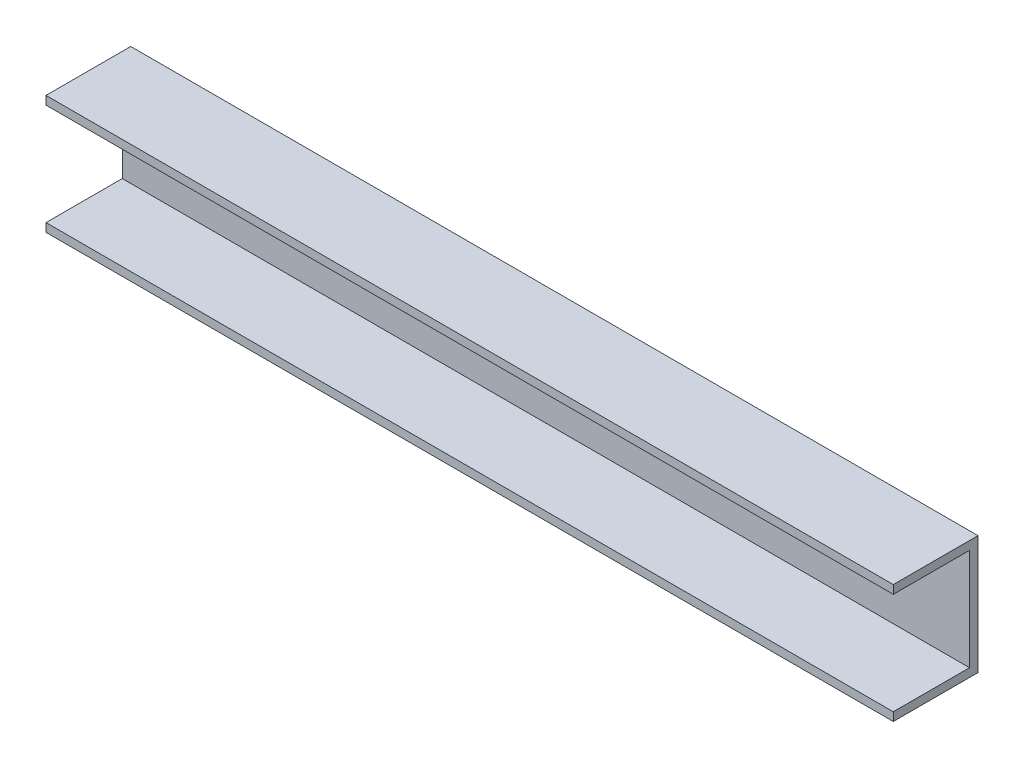
ISO-10303-21;
HEADER;
FILE_DESCRIPTION(('STEP AP214'),'2;1');
FILE_NAME('part.step','',(''),(''),'','','');
FILE_SCHEMA(('AUTOMOTIVE_DESIGN { 1 0 10303 214 1 1 1 1 }'));
ENDSEC;
DATA;
#1=APPLICATION_CONTEXT('core data for automotive mechanical design processes');
#2=APPLICATION_PROTOCOL_DEFINITION('international standard','automotive_design',2000,#1);
#3=PRODUCT_CONTEXT('',#1,'mechanical');
#4=PRODUCT('Part','Part','',(#3));
#5=PRODUCT_RELATED_PRODUCT_CATEGORY('part','',(#4));
#6=PRODUCT_DEFINITION_FORMATION('','',#4);
#7=PRODUCT_DEFINITION_CONTEXT('part definition',#1,'design');
#8=PRODUCT_DEFINITION('design','',#6,#7);
#9=PRODUCT_DEFINITION_SHAPE('','',#8);
#10=(LENGTH_UNIT() NAMED_UNIT(*) SI_UNIT(.MILLI.,.METRE.));
#11=(NAMED_UNIT(*) PLANE_ANGLE_UNIT() SI_UNIT($,.RADIAN.));
#12=(NAMED_UNIT(*) SI_UNIT($,.STERADIAN.) SOLID_ANGLE_UNIT());
#13=UNCERTAINTY_MEASURE_WITH_UNIT(LENGTH_MEASURE(1.E-05),#10,'distance_accuracy_value','');
#14=(GEOMETRIC_REPRESENTATION_CONTEXT(3) GLOBAL_UNCERTAINTY_ASSIGNED_CONTEXT((#13)) GLOBAL_UNIT_ASSIGNED_CONTEXT((#10,
#11,#12)) REPRESENTATION_CONTEXT('',''));
#15=CARTESIAN_POINT('',(0.,0.,0.));
#16=DIRECTION('',(0.,0.,1.));
#17=DIRECTION('',(1.,0.,0.));
#18=AXIS2_PLACEMENT_3D('',#15,#16,#17);
#19=CARTESIAN_POINT('',(250.,48.0101844378671,33.9593361452488));
#20=DIRECTION('',(0.,0.,-1.));
#21=DIRECTION('',(-1.,0.,0.));
#22=AXIS2_PLACEMENT_3D('',#19,#20,#21);
#23=PLANE('',#22);
#24=DIRECTION('',(0.,-1.,0.));
#25=VECTOR('',#24,1.);
#26=CARTESIAN_POINT('',(-250.,48.0101844378671,33.9593361452488));
#27=LINE('',#26,#25);
#28=CARTESIAN_POINT('',(-250.,53.0101844378671,33.9593361452488));
#29=VERTEX_POINT('',#28);
#30=CARTESIAN_POINT('',(-250.,48.0101844378671,33.9593361452488));
#31=VERTEX_POINT('',#30);
#32=EDGE_CURVE('E140',#29,#31,#27,.T.);
#33=ORIENTED_EDGE('',*,*,#32,.T.);
#34=DIRECTION('',(-1.,0.,0.));
#35=VECTOR('',#34,1.);
#36=CARTESIAN_POINT('',(250.,48.0101844378671,33.9593361452488));
#37=LINE('',#36,#35);
#38=CARTESIAN_POINT('',(250.,48.0101844378671,33.9593361452488));
#39=VERTEX_POINT('',#38);
#40=EDGE_CURVE('E11',#39,#31,#37,.T.);
#41=ORIENTED_EDGE('',*,*,#40,.F.);
#42=DIRECTION('',(0.,-1.,0.));
#43=VECTOR('',#42,1.);
#44=CARTESIAN_POINT('',(250.,48.0101844378671,33.9593361452488));
#45=LINE('',#44,#43);
#46=CARTESIAN_POINT('',(250.,53.0101844378671,33.9593361452488));
#47=VERTEX_POINT('',#46);
#48=EDGE_CURVE('E162',#47,#39,#45,.T.);
#49=ORIENTED_EDGE('',*,*,#48,.F.);
#50=DIRECTION('',(-1.,0.,0.));
#51=VECTOR('',#50,1.);
#52=CARTESIAN_POINT('',(250.,53.0101844378671,33.9593361452488));
#53=LINE('',#52,#51);
#54=EDGE_CURVE('E136',#47,#29,#53,.T.);
#55=ORIENTED_EDGE('',*,*,#54,.T.);
#56=EDGE_LOOP('',(#33,#41,#49,#55));
#57=FACE_BOUND('',#56,.T.);
#58=ADVANCED_FACE('F39',(#57),#23,.F.);
#59=CARTESIAN_POINT('',(250.,48.0101844378671,-11.0406638547512));
#60=DIRECTION('',(0.,1.,0.));
#61=DIRECTION('',(0.,0.,1.));
#62=AXIS2_PLACEMENT_3D('',#59,#60,#61);
#63=PLANE('',#62);
#64=DIRECTION('',(0.,0.,-1.));
#65=VECTOR('',#64,1.);
#66=CARTESIAN_POINT('',(-250.,48.0101844378671,-11.0406638547512));
#67=LINE('',#66,#65);
#68=CARTESIAN_POINT('',(-250.,48.0101844378671,-11.0406638547512));
#69=VERTEX_POINT('',#68);
#70=EDGE_CURVE('E144',#31,#69,#67,.T.);
#71=ORIENTED_EDGE('',*,*,#70,.T.);
#72=DIRECTION('',(-1.,0.,0.));
#73=VECTOR('',#72,1.);
#74=CARTESIAN_POINT('',(250.,48.0101844378671,-11.0406638547512));
#75=LINE('',#74,#73);
#76=CARTESIAN_POINT('',(250.,48.0101844378671,-11.0406638547512));
#77=VERTEX_POINT('',#76);
#78=EDGE_CURVE('E48',#77,#69,#75,.T.);
#79=ORIENTED_EDGE('',*,*,#78,.F.);
#80=DIRECTION('',(0.,0.,-1.));
#81=VECTOR('',#80,1.);
#82=CARTESIAN_POINT('',(250.,48.0101844378671,-11.0406638547512));
#83=LINE('',#82,#81);
#84=EDGE_CURVE('E99',#39,#77,#83,.T.);
#85=ORIENTED_EDGE('',*,*,#84,.F.);
#86=ORIENTED_EDGE('',*,*,#40,.T.);
#87=EDGE_LOOP('',(#71,#79,#85,#86));
#88=FACE_BOUND('',#87,.T.);
#89=ADVANCED_FACE('F208',(#88),#63,.F.);
#90=CARTESIAN_POINT('',(250.,-11.9898155621329,-11.0406638547512));
#91=DIRECTION('',(0.,0.,-1.));
#92=DIRECTION('',(0.,1.,0.));
#93=AXIS2_PLACEMENT_3D('',#90,#91,#92);
#94=PLANE('',#93);
#95=DIRECTION('',(0.,-1.,0.));
#96=VECTOR('',#95,1.);
#97=CARTESIAN_POINT('',(-250.,-11.9898155621329,-11.0406638547512));
#98=LINE('',#97,#96);
#99=CARTESIAN_POINT('',(-250.,-11.9898155621329,-11.0406638547512));
#100=VERTEX_POINT('',#99);
#101=EDGE_CURVE('E147',#69,#100,#98,.T.);
#102=ORIENTED_EDGE('',*,*,#101,.T.);
#103=DIRECTION('',(-1.,0.,0.));
#104=VECTOR('',#103,1.);
#105=CARTESIAN_POINT('',(250.,-11.9898155621329,-11.0406638547512));
#106=LINE('',#105,#104);
#107=CARTESIAN_POINT('',(250.,-11.9898155621329,-11.0406638547512));
#108=VERTEX_POINT('',#107);
#109=EDGE_CURVE('E173',#108,#100,#106,.T.);
#110=ORIENTED_EDGE('',*,*,#109,.F.);
#111=DIRECTION('',(0.,-1.,0.));
#112=VECTOR('',#111,1.);
#113=CARTESIAN_POINT('',(250.,-11.9898155621329,-11.0406638547512));
#114=LINE('',#113,#112);
#115=EDGE_CURVE('E183',#77,#108,#114,.T.);
#116=ORIENTED_EDGE('',*,*,#115,.F.);
#117=ORIENTED_EDGE('',*,*,#78,.T.);
#118=EDGE_LOOP('',(#102,#110,#116,#117));
#119=FACE_BOUND('',#118,.T.);
#120=ADVANCED_FACE('F181',(#119),#94,.F.);
#121=CARTESIAN_POINT('',(250.,-11.9898155621329,33.9593361452488));
#122=DIRECTION('',(0.,-1.,0.));
#123=DIRECTION('',(0.,0.,-1.));
#124=AXIS2_PLACEMENT_3D('',#121,#122,#123);
#125=PLANE('',#124);
#126=DIRECTION('',(0.,0.,1.));
#127=VECTOR('',#126,1.);
#128=CARTESIAN_POINT('',(-250.,-11.9898155621329,33.9593361452488));
#129=LINE('',#128,#127);
#130=CARTESIAN_POINT('',(-250.,-11.9898155621329,33.9593361452488));
#131=VERTEX_POINT('',#130);
#132=EDGE_CURVE('E150',#100,#131,#129,.T.);
#133=ORIENTED_EDGE('',*,*,#132,.T.);
#134=DIRECTION('',(-1.,0.,0.));
#135=VECTOR('',#134,1.);
#136=CARTESIAN_POINT('',(250.,-11.9898155621329,33.9593361452488));
#137=LINE('',#136,#135);
#138=CARTESIAN_POINT('',(250.,-11.9898155621329,33.9593361452488));
#139=VERTEX_POINT('',#138);
#140=EDGE_CURVE('E169',#139,#131,#137,.T.);
#141=ORIENTED_EDGE('',*,*,#140,.F.);
#142=DIRECTION('',(0.,0.,1.));
#143=VECTOR('',#142,1.);
#144=CARTESIAN_POINT('',(250.,-11.9898155621329,33.9593361452488));
#145=LINE('',#144,#143);
#146=EDGE_CURVE('E196',#108,#139,#145,.T.);
#147=ORIENTED_EDGE('',*,*,#146,.F.);
#148=ORIENTED_EDGE('',*,*,#109,.T.);
#149=EDGE_LOOP('',(#133,#141,#147,#148));
#150=FACE_BOUND('',#149,.T.);
#151=ADVANCED_FACE('F191',(#150),#125,.F.);
#152=CARTESIAN_POINT('',(250.,-16.9898155621329,33.9593361452488));
#153=DIRECTION('',(0.,0.,-1.));
#154=DIRECTION('',(-1.,0.,0.));
#155=AXIS2_PLACEMENT_3D('',#152,#153,#154);
#156=PLANE('',#155);
#157=DIRECTION('',(0.,-1.,0.));
#158=VECTOR('',#157,1.);
#159=CARTESIAN_POINT('',(-250.,-16.9898155621329,33.9593361452488));
#160=LINE('',#159,#158);
#161=CARTESIAN_POINT('',(-250.,-16.9898155621329,33.9593361452488));
#162=VERTEX_POINT('',#161);
#163=EDGE_CURVE('E153',#131,#162,#160,.T.);
#164=ORIENTED_EDGE('',*,*,#163,.T.);
#165=DIRECTION('',(-1.,0.,0.));
#166=VECTOR('',#165,1.);
#167=CARTESIAN_POINT('',(250.,-16.9898155621329,33.9593361452488));
#168=LINE('',#167,#166);
#169=CARTESIAN_POINT('',(250.,-16.9898155621329,33.9593361452488));
#170=VERTEX_POINT('',#169);
#171=EDGE_CURVE('E129',#170,#162,#168,.T.);
#172=ORIENTED_EDGE('',*,*,#171,.F.);
#173=DIRECTION('',(0.,-1.,0.));
#174=VECTOR('',#173,1.);
#175=CARTESIAN_POINT('',(250.,-16.9898155621329,33.9593361452488));
#176=LINE('',#175,#174);
#177=EDGE_CURVE('E118',#139,#170,#176,.T.);
#178=ORIENTED_EDGE('',*,*,#177,.F.);
#179=ORIENTED_EDGE('',*,*,#140,.T.);
#180=EDGE_LOOP('',(#164,#172,#178,#179));
#181=FACE_BOUND('',#180,.T.);
#182=ADVANCED_FACE('F194',(#181),#156,.F.);
#183=CARTESIAN_POINT('',(250.,-16.9898155621329,-16.0406638547512));
#184=DIRECTION('',(0.,1.,0.));
#185=DIRECTION('',(0.,0.,1.));
#186=AXIS2_PLACEMENT_3D('',#183,#184,#185);
#187=PLANE('',#186);
#188=DIRECTION('',(0.,0.,-1.));
#189=VECTOR('',#188,1.);
#190=CARTESIAN_POINT('',(-250.,-16.9898155621329,-16.0406638547512));
#191=LINE('',#190,#189);
#192=CARTESIAN_POINT('',(-250.,-16.9898155621329,-16.0406638547512));
#193=VERTEX_POINT('',#192);
#194=EDGE_CURVE('E127',#162,#193,#191,.T.);
#195=ORIENTED_EDGE('',*,*,#194,.T.);
#196=DIRECTION('',(-1.,0.,0.));
#197=VECTOR('',#196,1.);
#198=CARTESIAN_POINT('',(250.,-16.9898155621329,-16.0406638547512));
#199=LINE('',#198,#197);
#200=CARTESIAN_POINT('',(250.,-16.9898155621329,-16.0406638547512));
#201=VERTEX_POINT('',#200);
#202=EDGE_CURVE('E124',#201,#193,#199,.T.);
#203=ORIENTED_EDGE('',*,*,#202,.F.);
#204=DIRECTION('',(0.,0.,-1.));
#205=VECTOR('',#204,1.);
#206=CARTESIAN_POINT('',(250.,-16.9898155621329,-16.0406638547512));
#207=LINE('',#206,#205);
#208=EDGE_CURVE('E112',#170,#201,#207,.T.);
#209=ORIENTED_EDGE('',*,*,#208,.F.);
#210=ORIENTED_EDGE('',*,*,#171,.T.);
#211=EDGE_LOOP('',(#195,#203,#209,#210));
#212=FACE_BOUND('',#211,.T.);
#213=ADVANCED_FACE('F125',(#212),#187,.F.);
#214=CARTESIAN_POINT('',(250.,53.0101844378671,-16.0406638547512));
#215=DIRECTION('',(0.,0.,1.));
#216=DIRECTION('',(0.,-1.,0.));
#217=AXIS2_PLACEMENT_3D('',#214,#215,#216);
#218=PLANE('',#217);
#219=DIRECTION('',(0.,1.,0.));
#220=VECTOR('',#219,1.);
#221=CARTESIAN_POINT('',(-250.,53.0101844378671,-16.0406638547512));
#222=LINE('',#221,#220);
#223=CARTESIAN_POINT('',(-250.,53.0101844378671,-16.0406638547512));
#224=VERTEX_POINT('',#223);
#225=EDGE_CURVE('E85',#193,#224,#222,.T.);
#226=ORIENTED_EDGE('',*,*,#225,.T.);
#227=DIRECTION('',(-1.,0.,0.));
#228=VECTOR('',#227,1.);
#229=CARTESIAN_POINT('',(250.,53.0101844378671,-16.0406638547512));
#230=LINE('',#229,#228);
#231=CARTESIAN_POINT('',(250.,53.0101844378671,-16.0406638547512));
#232=VERTEX_POINT('',#231);
#233=EDGE_CURVE('E130',#232,#224,#230,.T.);
#234=ORIENTED_EDGE('',*,*,#233,.F.);
#235=DIRECTION('',(0.,1.,0.));
#236=VECTOR('',#235,1.);
#237=CARTESIAN_POINT('',(250.,53.0101844378671,-16.0406638547512));
#238=LINE('',#237,#236);
#239=EDGE_CURVE('E116',#201,#232,#238,.T.);
#240=ORIENTED_EDGE('',*,*,#239,.F.);
#241=ORIENTED_EDGE('',*,*,#202,.T.);
#242=EDGE_LOOP('',(#226,#234,#240,#241));
#243=FACE_BOUND('',#242,.T.);
#244=ADVANCED_FACE('F132',(#243),#218,.F.);
#245=CARTESIAN_POINT('',(250.,53.0101844378671,33.9593361452488));
#246=DIRECTION('',(0.,-1.,0.));
#247=DIRECTION('',(0.,0.,-1.));
#248=AXIS2_PLACEMENT_3D('',#245,#246,#247);
#249=PLANE('',#248);
#250=DIRECTION('',(0.,0.,1.));
#251=VECTOR('',#250,1.);
#252=CARTESIAN_POINT('',(-250.,53.0101844378671,33.9593361452488));
#253=LINE('',#252,#251);
#254=EDGE_CURVE('E91',#224,#29,#253,.T.);
#255=ORIENTED_EDGE('',*,*,#254,.T.);
#256=ORIENTED_EDGE('',*,*,#54,.F.);
#257=DIRECTION('',(0.,0.,1.));
#258=VECTOR('',#257,1.);
#259=CARTESIAN_POINT('',(250.,53.0101844378671,33.9593361452488));
#260=LINE('',#259,#258);
#261=EDGE_CURVE('E56',#232,#47,#260,.T.);
#262=ORIENTED_EDGE('',*,*,#261,.F.);
#263=ORIENTED_EDGE('',*,*,#233,.T.);
#264=EDGE_LOOP('',(#255,#256,#262,#263));
#265=FACE_BOUND('',#264,.T.);
#266=ADVANCED_FACE('F224',(#265),#249,.F.);
#267=CARTESIAN_POINT('',(250.,0.,0.));
#268=DIRECTION('',(-1.,0.,0.));
#269=DIRECTION('',(0.,0.,1.));
#270=AXIS2_PLACEMENT_3D('',#267,#268,#269);
#271=PLANE('',#270);
#272=ORIENTED_EDGE('',*,*,#48,.T.);
#273=ORIENTED_EDGE('',*,*,#84,.T.);
#274=ORIENTED_EDGE('',*,*,#115,.T.);
#275=ORIENTED_EDGE('',*,*,#146,.T.);
#276=ORIENTED_EDGE('',*,*,#177,.T.);
#277=ORIENTED_EDGE('',*,*,#208,.T.);
#278=ORIENTED_EDGE('',*,*,#239,.T.);
#279=ORIENTED_EDGE('',*,*,#261,.T.);
#280=EDGE_LOOP('',(#272,#273,#274,#275,#276,#277,#278,#279));
#281=FACE_BOUND('',#280,.T.);
#282=ADVANCED_FACE('F114',(#281),#271,.F.);
#283=CARTESIAN_POINT('',(-250.,0.,0.));
#284=DIRECTION('',(-1.,0.,0.));
#285=DIRECTION('',(0.,0.,1.));
#286=AXIS2_PLACEMENT_3D('',#283,#284,#285);
#287=PLANE('',#286);
#288=ORIENTED_EDGE('',*,*,#32,.F.);
#289=ORIENTED_EDGE('',*,*,#254,.F.);
#290=ORIENTED_EDGE('',*,*,#225,.F.);
#291=ORIENTED_EDGE('',*,*,#194,.F.);
#292=ORIENTED_EDGE('',*,*,#163,.F.);
#293=ORIENTED_EDGE('',*,*,#132,.F.);
#294=ORIENTED_EDGE('',*,*,#101,.F.);
#295=ORIENTED_EDGE('',*,*,#70,.F.);
#296=EDGE_LOOP('',(#288,#289,#290,#291,#292,#293,#294,#295));
#297=FACE_BOUND('',#296,.T.);
#298=ADVANCED_FACE('F187',(#297),#287,.T.);
#299=CLOSED_SHELL('',(#58,#89,#120,#151,#182,#213,#244,#266,#282,#298));
#300=MANIFOLD_SOLID_BREP('B2',#299);
#301=ADVANCED_BREP_SHAPE_REPRESENTATION('',(#18,#300),#14);
#302=SHAPE_DEFINITION_REPRESENTATION(#9,#301);
ENDSEC;
END-ISO-10303-21;
